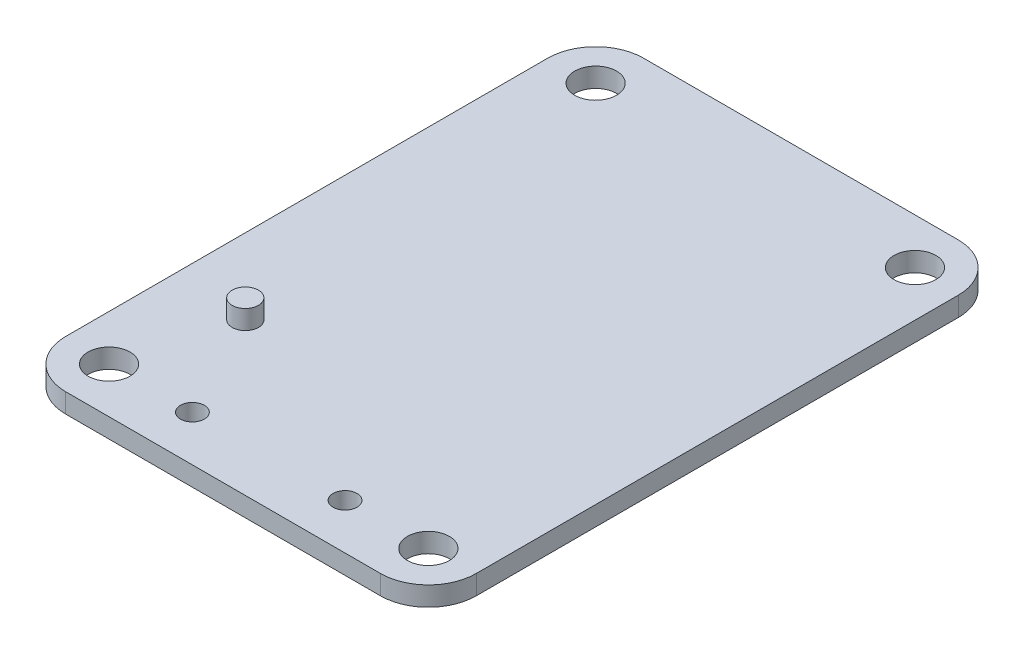
ISO-10303-21;
HEADER;
FILE_DESCRIPTION(('STEP AP214'),'2;1');
FILE_NAME('part.step','',(''),(''),'','','');
FILE_SCHEMA(('AUTOMOTIVE_DESIGN { 1 0 10303 214 1 1 1 1 }'));
ENDSEC;
DATA;
#1=APPLICATION_CONTEXT('core data for automotive mechanical design processes');
#2=APPLICATION_PROTOCOL_DEFINITION('international standard','automotive_design',2000,#1);
#3=PRODUCT_CONTEXT('',#1,'mechanical');
#4=PRODUCT('Part','Part','',(#3));
#5=PRODUCT_RELATED_PRODUCT_CATEGORY('part','',(#4));
#6=PRODUCT_DEFINITION_FORMATION('','',#4);
#7=PRODUCT_DEFINITION_CONTEXT('part definition',#1,'design');
#8=PRODUCT_DEFINITION('design','',#6,#7);
#9=PRODUCT_DEFINITION_SHAPE('','',#8);
#10=(LENGTH_UNIT() NAMED_UNIT(*) SI_UNIT(.MILLI.,.METRE.));
#11=(NAMED_UNIT(*) PLANE_ANGLE_UNIT() SI_UNIT($,.RADIAN.));
#12=(NAMED_UNIT(*) SI_UNIT($,.STERADIAN.) SOLID_ANGLE_UNIT());
#13=UNCERTAINTY_MEASURE_WITH_UNIT(LENGTH_MEASURE(1.E-05),#10,'distance_accuracy_value','');
#14=(GEOMETRIC_REPRESENTATION_CONTEXT(3) GLOBAL_UNCERTAINTY_ASSIGNED_CONTEXT((#13)) GLOBAL_UNIT_ASSIGNED_CONTEXT((#10,
#11,#12)) REPRESENTATION_CONTEXT('',''));
#15=CARTESIAN_POINT('',(0.,0.,0.));
#16=DIRECTION('',(0.,0.,1.));
#17=DIRECTION('',(1.,0.,0.));
#18=AXIS2_PLACEMENT_3D('',#15,#16,#17);
#19=CARTESIAN_POINT('',(0.,1.62,0.));
#20=DIRECTION('',(0.,1.,0.));
#21=DIRECTION('',(0.,0.,1.));
#22=AXIS2_PLACEMENT_3D('',#19,#20,#21);
#23=PLANE('',#22);
#24=CARTESIAN_POINT('',(6.3,1.62,-12.7));
#25=DIRECTION('',(0.,1.,0.));
#26=DIRECTION('',(0.,0.,1.));
#27=AXIS2_PLACEMENT_3D('',#24,#25,#26);
#28=CIRCLE('',#27,1.1);
#29=CARTESIAN_POINT('',(6.3,1.62,-11.6));
#30=VERTEX_POINT('',#29);
#31=EDGE_CURVE('E214',#30,#30,#28,.T.);
#32=ORIENTED_EDGE('',*,*,#31,.F.);
#33=EDGE_LOOP('',(#32));
#34=FACE_BOUND('',#33,.T.);
#35=DIRECTION('',(-1.,0.,0.));
#36=VECTOR('',#35,1.);
#37=CARTESIAN_POINT('',(0.,1.62,-48.26));
#38=LINE('',#37,#36);
#39=CARTESIAN_POINT('',(30.29,1.62,-48.26));
#40=VERTEX_POINT('',#39);
#41=CARTESIAN_POINT('',(4.,1.62,-48.26));
#42=VERTEX_POINT('',#41);
#43=EDGE_CURVE('E189',#40,#42,#38,.T.);
#44=ORIENTED_EDGE('',*,*,#43,.T.);
#45=CARTESIAN_POINT('',(4.,1.62,-44.26));
#46=DIRECTION('',(0.,1.,0.));
#47=DIRECTION('',(0.,0.,1.));
#48=AXIS2_PLACEMENT_3D('',#45,#46,#47);
#49=CIRCLE('',#48,4.);
#50=CARTESIAN_POINT('',(0.,1.62,-44.26));
#51=VERTEX_POINT('',#50);
#52=EDGE_CURVE('E92',#42,#51,#49,.T.);
#53=ORIENTED_EDGE('',*,*,#52,.T.);
#54=DIRECTION('',(0.,0.,1.));
#55=VECTOR('',#54,1.);
#56=CARTESIAN_POINT('',(0.,1.62,0.));
#57=LINE('',#56,#55);
#58=CARTESIAN_POINT('',(0.,1.62,-4.));
#59=VERTEX_POINT('',#58);
#60=EDGE_CURVE('E171',#51,#59,#57,.T.);
#61=ORIENTED_EDGE('',*,*,#60,.T.);
#62=CARTESIAN_POINT('',(4.,1.62,-4.));
#63=DIRECTION('',(0.,1.,0.));
#64=DIRECTION('',(0.,0.,1.));
#65=AXIS2_PLACEMENT_3D('',#62,#63,#64);
#66=CIRCLE('',#65,4.);
#67=CARTESIAN_POINT('',(4.,1.62,0.));
#68=VERTEX_POINT('',#67);
#69=EDGE_CURVE('E184',#59,#68,#66,.T.);
#70=ORIENTED_EDGE('',*,*,#69,.T.);
#71=DIRECTION('',(1.,0.,0.));
#72=VECTOR('',#71,1.);
#73=CARTESIAN_POINT('',(0.,1.62,0.));
#74=LINE('',#73,#72);
#75=CARTESIAN_POINT('',(30.29,1.62,0.));
#76=VERTEX_POINT('',#75);
#77=EDGE_CURVE('E111',#68,#76,#74,.T.);
#78=ORIENTED_EDGE('',*,*,#77,.T.);
#79=CARTESIAN_POINT('',(30.29,1.62,-4.));
#80=DIRECTION('',(0.,1.,0.));
#81=DIRECTION('',(0.,0.,1.));
#82=AXIS2_PLACEMENT_3D('',#79,#80,#81);
#83=CIRCLE('',#82,4.);
#84=CARTESIAN_POINT('',(34.29,1.62,-4.));
#85=VERTEX_POINT('',#84);
#86=EDGE_CURVE('E105',#76,#85,#83,.T.);
#87=ORIENTED_EDGE('',*,*,#86,.T.);
#88=DIRECTION('',(0.,0.,-1.));
#89=VECTOR('',#88,1.);
#90=CARTESIAN_POINT('',(34.29,1.62,0.));
#91=LINE('',#90,#89);
#92=CARTESIAN_POINT('',(34.29,1.62,-44.26));
#93=VERTEX_POINT('',#92);
#94=EDGE_CURVE('E109',#85,#93,#91,.T.);
#95=ORIENTED_EDGE('',*,*,#94,.T.);
#96=CARTESIAN_POINT('',(30.29,1.62,-44.26));
#97=DIRECTION('',(0.,1.,0.));
#98=DIRECTION('',(0.,0.,1.));
#99=AXIS2_PLACEMENT_3D('',#96,#97,#98);
#100=CIRCLE('',#99,4.);
#101=EDGE_CURVE('E49',#93,#40,#100,.T.);
#102=ORIENTED_EDGE('',*,*,#101,.T.);
#103=EDGE_LOOP('',(#44,#53,#61,#70,#78,#87,#95,#102));
#104=FACE_BOUND('',#103,.T.);
#105=CARTESIAN_POINT('',(3.81,1.62,-3.81));
#106=DIRECTION('',(0.,1.,0.));
#107=DIRECTION('',(0.,0.,1.));
#108=AXIS2_PLACEMENT_3D('',#105,#106,#107);
#109=CIRCLE('',#108,1.75);
#110=CARTESIAN_POINT('',(3.81,1.62,-2.06));
#111=VERTEX_POINT('',#110);
#112=EDGE_CURVE('E191',#111,#111,#109,.T.);
#113=ORIENTED_EDGE('',*,*,#112,.F.);
#114=EDGE_LOOP('',(#113));
#115=FACE_BOUND('',#114,.T.);
#116=CARTESIAN_POINT('',(30.48,1.62,-3.81));
#117=DIRECTION('',(0.,1.,0.));
#118=DIRECTION('',(0.,0.,1.));
#119=AXIS2_PLACEMENT_3D('',#116,#117,#118);
#120=CIRCLE('',#119,1.75);
#121=CARTESIAN_POINT('',(30.48,1.62,-2.06));
#122=VERTEX_POINT('',#121);
#123=EDGE_CURVE('E194',#122,#122,#120,.T.);
#124=ORIENTED_EDGE('',*,*,#123,.F.);
#125=EDGE_LOOP('',(#124));
#126=FACE_BOUND('',#125,.T.);
#127=CARTESIAN_POINT('',(3.81,1.62,-44.45));
#128=DIRECTION('',(0.,1.,0.));
#129=DIRECTION('',(0.,0.,1.));
#130=AXIS2_PLACEMENT_3D('',#127,#128,#129);
#131=CIRCLE('',#130,1.75);
#132=CARTESIAN_POINT('',(3.81,1.62,-42.7));
#133=VERTEX_POINT('',#132);
#134=EDGE_CURVE('E197',#133,#133,#131,.T.);
#135=ORIENTED_EDGE('',*,*,#134,.F.);
#136=EDGE_LOOP('',(#135));
#137=FACE_BOUND('',#136,.T.);
#138=CARTESIAN_POINT('',(30.48,1.62,-44.45));
#139=DIRECTION('',(0.,1.,0.));
#140=DIRECTION('',(0.,0.,1.));
#141=AXIS2_PLACEMENT_3D('',#138,#139,#140);
#142=CIRCLE('',#141,1.75);
#143=CARTESIAN_POINT('',(30.48,1.62,-42.7));
#144=VERTEX_POINT('',#143);
#145=EDGE_CURVE('E156',#144,#144,#142,.T.);
#146=ORIENTED_EDGE('',*,*,#145,.F.);
#147=EDGE_LOOP('',(#146));
#148=FACE_BOUND('',#147,.T.);
#149=CARTESIAN_POINT('',(10.77,1.62,-3.81));
#150=DIRECTION('',(0.,1.,0.));
#151=DIRECTION('',(0.,0.,1.));
#152=AXIS2_PLACEMENT_3D('',#149,#150,#151);
#153=CIRCLE('',#152,1.);
#154=CARTESIAN_POINT('',(10.77,1.62,-2.81));
#155=VERTEX_POINT('',#154);
#156=EDGE_CURVE('E205',#155,#155,#153,.T.);
#157=ORIENTED_EDGE('',*,*,#156,.F.);
#158=EDGE_LOOP('',(#157));
#159=FACE_BOUND('',#158,.T.);
#160=CARTESIAN_POINT('',(23.52,1.62,-3.81));
#161=DIRECTION('',(0.,1.,0.));
#162=DIRECTION('',(0.,0.,1.));
#163=AXIS2_PLACEMENT_3D('',#160,#161,#162);
#164=CIRCLE('',#163,1.);
#165=CARTESIAN_POINT('',(23.52,1.62,-2.81));
#166=VERTEX_POINT('',#165);
#167=EDGE_CURVE('E209',#166,#166,#164,.F.);
#168=ORIENTED_EDGE('',*,*,#167,.T.);
#169=EDGE_LOOP('',(#168));
#170=FACE_BOUND('',#169,.T.);
#171=ADVANCED_FACE('F32',(#34,#104,#115,#126,#137,#148,#159,#170),#23,.T.);
#172=CARTESIAN_POINT('',(0.,0.,0.));
#173=DIRECTION('',(0.,1.,0.));
#174=DIRECTION('',(0.,0.,1.));
#175=AXIS2_PLACEMENT_3D('',#172,#173,#174);
#176=PLANE('',#175);
#177=CARTESIAN_POINT('',(10.77,0.,-3.81));
#178=DIRECTION('',(0.,1.,0.));
#179=DIRECTION('',(0.,0.,1.));
#180=AXIS2_PLACEMENT_3D('',#177,#178,#179);
#181=CIRCLE('',#180,1.);
#182=CARTESIAN_POINT('',(10.77,0.,-2.81));
#183=VERTEX_POINT('',#182);
#184=EDGE_CURVE('E202',#183,#183,#181,.T.);
#185=ORIENTED_EDGE('',*,*,#184,.T.);
#186=EDGE_LOOP('',(#185));
#187=FACE_BOUND('',#186,.T.);
#188=CARTESIAN_POINT('',(30.48,0.,-44.45));
#189=DIRECTION('',(0.,1.,0.));
#190=DIRECTION('',(0.,0.,1.));
#191=AXIS2_PLACEMENT_3D('',#188,#189,#190);
#192=CIRCLE('',#191,1.75);
#193=CARTESIAN_POINT('',(30.48,0.,-42.7));
#194=VERTEX_POINT('',#193);
#195=EDGE_CURVE('E129',#194,#194,#192,.T.);
#196=ORIENTED_EDGE('',*,*,#195,.T.);
#197=EDGE_LOOP('',(#196));
#198=FACE_BOUND('',#197,.T.);
#199=CARTESIAN_POINT('',(3.81,0.,-44.45));
#200=DIRECTION('',(0.,1.,0.));
#201=DIRECTION('',(0.,0.,1.));
#202=AXIS2_PLACEMENT_3D('',#199,#200,#201);
#203=CIRCLE('',#202,1.75);
#204=CARTESIAN_POINT('',(3.81,0.,-42.7));
#205=VERTEX_POINT('',#204);
#206=EDGE_CURVE('E132',#205,#205,#203,.T.);
#207=ORIENTED_EDGE('',*,*,#206,.T.);
#208=EDGE_LOOP('',(#207));
#209=FACE_BOUND('',#208,.T.);
#210=CARTESIAN_POINT('',(30.48,0.,-3.81));
#211=DIRECTION('',(0.,1.,0.));
#212=DIRECTION('',(0.,0.,1.));
#213=AXIS2_PLACEMENT_3D('',#210,#211,#212);
#214=CIRCLE('',#213,1.75);
#215=CARTESIAN_POINT('',(30.48,0.,-2.06));
#216=VERTEX_POINT('',#215);
#217=EDGE_CURVE('E136',#216,#216,#214,.T.);
#218=ORIENTED_EDGE('',*,*,#217,.T.);
#219=EDGE_LOOP('',(#218));
#220=FACE_BOUND('',#219,.T.);
#221=CARTESIAN_POINT('',(3.81,0.,-3.81));
#222=DIRECTION('',(0.,1.,0.));
#223=DIRECTION('',(0.,0.,1.));
#224=AXIS2_PLACEMENT_3D('',#221,#222,#223);
#225=CIRCLE('',#224,1.75);
#226=CARTESIAN_POINT('',(3.81,0.,-2.06));
#227=VERTEX_POINT('',#226);
#228=EDGE_CURVE('E139',#227,#227,#225,.T.);
#229=ORIENTED_EDGE('',*,*,#228,.T.);
#230=EDGE_LOOP('',(#229));
#231=FACE_BOUND('',#230,.T.);
#232=DIRECTION('',(-1.,0.,0.));
#233=VECTOR('',#232,1.);
#234=CARTESIAN_POINT('',(0.,0.,-48.26));
#235=LINE('',#234,#233);
#236=CARTESIAN_POINT('',(30.29,0.,-48.26));
#237=VERTEX_POINT('',#236);
#238=CARTESIAN_POINT('',(4.,0.,-48.26));
#239=VERTEX_POINT('',#238);
#240=EDGE_CURVE('E142',#237,#239,#235,.T.);
#241=ORIENTED_EDGE('',*,*,#240,.F.);
#242=CARTESIAN_POINT('',(30.29,0.,-44.26));
#243=DIRECTION('',(0.,1.,0.));
#244=DIRECTION('',(0.,0.,1.));
#245=AXIS2_PLACEMENT_3D('',#242,#243,#244);
#246=CIRCLE('',#245,4.);
#247=CARTESIAN_POINT('',(34.29,0.,-44.26));
#248=VERTEX_POINT('',#247);
#249=EDGE_CURVE('E84',#248,#237,#246,.T.);
#250=ORIENTED_EDGE('',*,*,#249,.F.);
#251=DIRECTION('',(0.,0.,-1.));
#252=VECTOR('',#251,1.);
#253=CARTESIAN_POINT('',(34.29,0.,0.));
#254=LINE('',#253,#252);
#255=CARTESIAN_POINT('',(34.29,0.,-4.));
#256=VERTEX_POINT('',#255);
#257=EDGE_CURVE('E78',#256,#248,#254,.T.);
#258=ORIENTED_EDGE('',*,*,#257,.F.);
#259=CARTESIAN_POINT('',(30.29,0.,-4.));
#260=DIRECTION('',(0.,1.,0.));
#261=DIRECTION('',(0.,0.,1.));
#262=AXIS2_PLACEMENT_3D('',#259,#260,#261);
#263=CIRCLE('',#262,4.);
#264=CARTESIAN_POINT('',(30.29,0.,0.));
#265=VERTEX_POINT('',#264);
#266=EDGE_CURVE('E119',#265,#256,#263,.T.);
#267=ORIENTED_EDGE('',*,*,#266,.F.);
#268=DIRECTION('',(1.,0.,0.));
#269=VECTOR('',#268,1.);
#270=CARTESIAN_POINT('',(0.,0.,0.));
#271=LINE('',#270,#269);
#272=CARTESIAN_POINT('',(4.,0.,0.));
#273=VERTEX_POINT('',#272);
#274=EDGE_CURVE('E151',#273,#265,#271,.T.);
#275=ORIENTED_EDGE('',*,*,#274,.F.);
#276=CARTESIAN_POINT('',(4.,0.,-4.));
#277=DIRECTION('',(0.,1.,0.));
#278=DIRECTION('',(0.,0.,1.));
#279=AXIS2_PLACEMENT_3D('',#276,#277,#278);
#280=CIRCLE('',#279,4.);
#281=CARTESIAN_POINT('',(0.,0.,-4.));
#282=VERTEX_POINT('',#281);
#283=EDGE_CURVE('E149',#282,#273,#280,.T.);
#284=ORIENTED_EDGE('',*,*,#283,.F.);
#285=DIRECTION('',(0.,0.,1.));
#286=VECTOR('',#285,1.);
#287=CARTESIAN_POINT('',(0.,0.,0.));
#288=LINE('',#287,#286);
#289=CARTESIAN_POINT('',(0.,0.,-44.26));
#290=VERTEX_POINT('',#289);
#291=EDGE_CURVE('E147',#290,#282,#288,.T.);
#292=ORIENTED_EDGE('',*,*,#291,.F.);
#293=CARTESIAN_POINT('',(4.,0.,-44.26));
#294=DIRECTION('',(0.,1.,0.));
#295=DIRECTION('',(0.,0.,1.));
#296=AXIS2_PLACEMENT_3D('',#293,#294,#295);
#297=CIRCLE('',#296,4.);
#298=EDGE_CURVE('E145',#239,#290,#297,.T.);
#299=ORIENTED_EDGE('',*,*,#298,.F.);
#300=EDGE_LOOP('',(#241,#250,#258,#267,#275,#284,#292,#299));
#301=FACE_BOUND('',#300,.T.);
#302=CARTESIAN_POINT('',(23.52,0.,-3.81));
#303=DIRECTION('',(0.,1.,0.));
#304=DIRECTION('',(0.,0.,1.));
#305=AXIS2_PLACEMENT_3D('',#302,#303,#304);
#306=CIRCLE('',#305,1.);
#307=CARTESIAN_POINT('',(23.52,0.,-2.81));
#308=VERTEX_POINT('',#307);
#309=EDGE_CURVE('E133',#308,#308,#306,.F.);
#310=ORIENTED_EDGE('',*,*,#309,.F.);
#311=EDGE_LOOP('',(#310));
#312=FACE_BOUND('',#311,.T.);
#313=ADVANCED_FACE('F175',(#187,#198,#209,#220,#231,#301,#312),#176,.F.);
#314=CARTESIAN_POINT('',(0.,1.62,-48.26));
#315=DIRECTION('',(0.,0.,1.));
#316=DIRECTION('',(1.,0.,0.));
#317=AXIS2_PLACEMENT_3D('',#314,#315,#316);
#318=PLANE('',#317);
#319=ORIENTED_EDGE('',*,*,#240,.T.);
#320=DIRECTION('',(0.,-1.,0.));
#321=VECTOR('',#320,1.);
#322=CARTESIAN_POINT('',(4.,1.62,-48.26));
#323=LINE('',#322,#321);
#324=EDGE_CURVE('E11',#42,#239,#323,.T.);
#325=ORIENTED_EDGE('',*,*,#324,.F.);
#326=ORIENTED_EDGE('',*,*,#43,.F.);
#327=DIRECTION('',(0.,-1.,0.));
#328=VECTOR('',#327,1.);
#329=CARTESIAN_POINT('',(30.29,1.62,-48.26));
#330=LINE('',#329,#328);
#331=EDGE_CURVE('E125',#40,#237,#330,.T.);
#332=ORIENTED_EDGE('',*,*,#331,.T.);
#333=EDGE_LOOP('',(#319,#325,#326,#332));
#334=FACE_BOUND('',#333,.T.);
#335=ADVANCED_FACE('F234',(#334),#318,.F.);
#336=CARTESIAN_POINT('',(4.,1.62,-44.26));
#337=DIRECTION('',(0.,-1.,0.));
#338=DIRECTION('',(0.,0.,-1.));
#339=AXIS2_PLACEMENT_3D('',#336,#337,#338);
#340=CYLINDRICAL_SURFACE('',#339,4.);
#341=ORIENTED_EDGE('',*,*,#298,.T.);
#342=DIRECTION('',(0.,-1.,0.));
#343=VECTOR('',#342,1.);
#344=CARTESIAN_POINT('',(0.,1.62,-44.26));
#345=LINE('',#344,#343);
#346=EDGE_CURVE('E41',#51,#290,#345,.T.);
#347=ORIENTED_EDGE('',*,*,#346,.F.);
#348=ORIENTED_EDGE('',*,*,#52,.F.);
#349=ORIENTED_EDGE('',*,*,#324,.T.);
#350=EDGE_LOOP('',(#341,#347,#348,#349));
#351=FACE_BOUND('',#350,.T.);
#352=ADVANCED_FACE('F255',(#351),#340,.T.);
#353=CARTESIAN_POINT('',(0.,1.62,0.));
#354=DIRECTION('',(1.,0.,0.));
#355=DIRECTION('',(0.,0.,-1.));
#356=AXIS2_PLACEMENT_3D('',#353,#354,#355);
#357=PLANE('',#356);
#358=ORIENTED_EDGE('',*,*,#291,.T.);
#359=DIRECTION('',(0.,-1.,0.));
#360=VECTOR('',#359,1.);
#361=CARTESIAN_POINT('',(0.,1.62,-4.));
#362=LINE('',#361,#360);
#363=EDGE_CURVE('E163',#59,#282,#362,.T.);
#364=ORIENTED_EDGE('',*,*,#363,.F.);
#365=ORIENTED_EDGE('',*,*,#60,.F.);
#366=ORIENTED_EDGE('',*,*,#346,.T.);
#367=EDGE_LOOP('',(#358,#364,#365,#366));
#368=FACE_BOUND('',#367,.T.);
#369=ADVANCED_FACE('F169',(#368),#357,.F.);
#370=CARTESIAN_POINT('',(4.,1.62,-4.));
#371=DIRECTION('',(0.,-1.,0.));
#372=DIRECTION('',(0.,0.,-1.));
#373=AXIS2_PLACEMENT_3D('',#370,#371,#372);
#374=CYLINDRICAL_SURFACE('',#373,4.);
#375=ORIENTED_EDGE('',*,*,#283,.T.);
#376=DIRECTION('',(0.,-1.,0.));
#377=VECTOR('',#376,1.);
#378=CARTESIAN_POINT('',(4.,1.62,0.));
#379=LINE('',#378,#377);
#380=EDGE_CURVE('E160',#68,#273,#379,.T.);
#381=ORIENTED_EDGE('',*,*,#380,.F.);
#382=ORIENTED_EDGE('',*,*,#69,.F.);
#383=ORIENTED_EDGE('',*,*,#363,.T.);
#384=EDGE_LOOP('',(#375,#381,#382,#383));
#385=FACE_BOUND('',#384,.T.);
#386=ADVANCED_FACE('F180',(#385),#374,.T.);
#387=CARTESIAN_POINT('',(0.,1.62,0.));
#388=DIRECTION('',(0.,0.,-1.));
#389=DIRECTION('',(-1.,0.,0.));
#390=AXIS2_PLACEMENT_3D('',#387,#388,#389);
#391=PLANE('',#390);
#392=ORIENTED_EDGE('',*,*,#274,.T.);
#393=DIRECTION('',(0.,-1.,0.));
#394=VECTOR('',#393,1.);
#395=CARTESIAN_POINT('',(30.29,1.62,0.));
#396=LINE('',#395,#394);
#397=EDGE_CURVE('E120',#76,#265,#396,.T.);
#398=ORIENTED_EDGE('',*,*,#397,.F.);
#399=ORIENTED_EDGE('',*,*,#77,.F.);
#400=ORIENTED_EDGE('',*,*,#380,.T.);
#401=EDGE_LOOP('',(#392,#398,#399,#400));
#402=FACE_BOUND('',#401,.T.);
#403=ADVANCED_FACE('F183',(#402),#391,.F.);
#404=CARTESIAN_POINT('',(30.29,1.62,-4.));
#405=DIRECTION('',(0.,-1.,0.));
#406=DIRECTION('',(0.,0.,-1.));
#407=AXIS2_PLACEMENT_3D('',#404,#405,#406);
#408=CYLINDRICAL_SURFACE('',#407,4.);
#409=ORIENTED_EDGE('',*,*,#266,.T.);
#410=DIRECTION('',(0.,-1.,0.));
#411=VECTOR('',#410,1.);
#412=CARTESIAN_POINT('',(34.29,1.62,-4.));
#413=LINE('',#412,#411);
#414=EDGE_CURVE('E116',#85,#256,#413,.T.);
#415=ORIENTED_EDGE('',*,*,#414,.F.);
#416=ORIENTED_EDGE('',*,*,#86,.F.);
#417=ORIENTED_EDGE('',*,*,#397,.T.);
#418=EDGE_LOOP('',(#409,#415,#416,#417));
#419=FACE_BOUND('',#418,.T.);
#420=ADVANCED_FACE('F117',(#419),#408,.T.);
#421=CARTESIAN_POINT('',(34.29,1.62,0.));
#422=DIRECTION('',(-1.,0.,0.));
#423=DIRECTION('',(0.,0.,1.));
#424=AXIS2_PLACEMENT_3D('',#421,#422,#423);
#425=PLANE('',#424);
#426=ORIENTED_EDGE('',*,*,#257,.T.);
#427=DIRECTION('',(0.,-1.,0.));
#428=VECTOR('',#427,1.);
#429=CARTESIAN_POINT('',(34.29,1.62,-44.26));
#430=LINE('',#429,#428);
#431=EDGE_CURVE('E121',#93,#248,#430,.T.);
#432=ORIENTED_EDGE('',*,*,#431,.F.);
#433=ORIENTED_EDGE('',*,*,#94,.F.);
#434=ORIENTED_EDGE('',*,*,#414,.T.);
#435=EDGE_LOOP('',(#426,#432,#433,#434));
#436=FACE_BOUND('',#435,.T.);
#437=ADVANCED_FACE('F123',(#436),#425,.F.);
#438=CARTESIAN_POINT('',(3.81,1.62,-3.81));
#439=DIRECTION('',(0.,-1.,0.));
#440=DIRECTION('',(0.,0.,-1.));
#441=AXIS2_PLACEMENT_3D('',#438,#439,#440);
#442=CYLINDRICAL_SURFACE('',#441,1.75);
#443=ORIENTED_EDGE('',*,*,#112,.T.);
#444=EDGE_LOOP('',(#443));
#445=FACE_BOUND('',#444,.T.);
#446=ORIENTED_EDGE('',*,*,#228,.F.);
#447=EDGE_LOOP('',(#446));
#448=FACE_BOUND('',#447,.T.);
#449=ADVANCED_FACE('F246',(#445,#448),#442,.F.);
#450=CARTESIAN_POINT('',(30.48,1.62,-3.81));
#451=DIRECTION('',(0.,-1.,0.));
#452=DIRECTION('',(0.,0.,-1.));
#453=AXIS2_PLACEMENT_3D('',#450,#451,#452);
#454=CYLINDRICAL_SURFACE('',#453,1.75);
#455=ORIENTED_EDGE('',*,*,#123,.T.);
#456=EDGE_LOOP('',(#455));
#457=FACE_BOUND('',#456,.T.);
#458=ORIENTED_EDGE('',*,*,#217,.F.);
#459=EDGE_LOOP('',(#458));
#460=FACE_BOUND('',#459,.T.);
#461=ADVANCED_FACE('F263',(#457,#460),#454,.F.);
#462=CARTESIAN_POINT('',(3.81,1.62,-44.45));
#463=DIRECTION('',(0.,-1.,0.));
#464=DIRECTION('',(0.,0.,-1.));
#465=AXIS2_PLACEMENT_3D('',#462,#463,#464);
#466=CYLINDRICAL_SURFACE('',#465,1.75);
#467=ORIENTED_EDGE('',*,*,#134,.T.);
#468=EDGE_LOOP('',(#467));
#469=FACE_BOUND('',#468,.T.);
#470=ORIENTED_EDGE('',*,*,#206,.F.);
#471=EDGE_LOOP('',(#470));
#472=FACE_BOUND('',#471,.T.);
#473=ADVANCED_FACE('F266',(#469,#472),#466,.F.);
#474=CARTESIAN_POINT('',(30.48,1.62,-44.45));
#475=DIRECTION('',(0.,-1.,0.));
#476=DIRECTION('',(0.,0.,-1.));
#477=AXIS2_PLACEMENT_3D('',#474,#475,#476);
#478=CYLINDRICAL_SURFACE('',#477,1.75);
#479=ORIENTED_EDGE('',*,*,#145,.T.);
#480=EDGE_LOOP('',(#479));
#481=FACE_BOUND('',#480,.T.);
#482=ORIENTED_EDGE('',*,*,#195,.F.);
#483=EDGE_LOOP('',(#482));
#484=FACE_BOUND('',#483,.T.);
#485=ADVANCED_FACE('F34',(#481,#484),#478,.F.);
#486=CARTESIAN_POINT('',(30.29,1.62,-44.26));
#487=DIRECTION('',(0.,-1.,0.));
#488=DIRECTION('',(0.,0.,-1.));
#489=AXIS2_PLACEMENT_3D('',#486,#487,#488);
#490=CYLINDRICAL_SURFACE('',#489,4.);
#491=ORIENTED_EDGE('',*,*,#249,.T.);
#492=ORIENTED_EDGE('',*,*,#331,.F.);
#493=ORIENTED_EDGE('',*,*,#101,.F.);
#494=ORIENTED_EDGE('',*,*,#431,.T.);
#495=EDGE_LOOP('',(#491,#492,#493,#494));
#496=FACE_BOUND('',#495,.T.);
#497=ADVANCED_FACE('F241',(#496),#490,.T.);
#498=CARTESIAN_POINT('',(10.77,0.,-3.81));
#499=DIRECTION('',(0.,1.,0.));
#500=DIRECTION('',(0.,0.,1.));
#501=AXIS2_PLACEMENT_3D('',#498,#499,#500);
#502=CYLINDRICAL_SURFACE('',#501,1.);
#503=ORIENTED_EDGE('',*,*,#184,.F.);
#504=EDGE_LOOP('',(#503));
#505=FACE_BOUND('',#504,.T.);
#506=ORIENTED_EDGE('',*,*,#156,.T.);
#507=EDGE_LOOP('',(#506));
#508=FACE_BOUND('',#507,.T.);
#509=ADVANCED_FACE('F238',(#505,#508),#502,.F.);
#510=CARTESIAN_POINT('',(23.52,0.,-3.81));
#511=DIRECTION('',(0.,1.,0.));
#512=DIRECTION('',(0.,0.,1.));
#513=AXIS2_PLACEMENT_3D('',#510,#511,#512);
#514=CYLINDRICAL_SURFACE('',#513,1.);
#515=ORIENTED_EDGE('',*,*,#309,.T.);
#516=EDGE_LOOP('',(#515));
#517=FACE_BOUND('',#516,.T.);
#518=ORIENTED_EDGE('',*,*,#167,.F.);
#519=EDGE_LOOP('',(#518));
#520=FACE_BOUND('',#519,.T.);
#521=ADVANCED_FACE('F225',(#517,#520),#514,.F.);
#522=CARTESIAN_POINT('',(6.3,3.22,-12.7));
#523=DIRECTION('',(0.,-1.,0.));
#524=DIRECTION('',(0.,0.,-1.));
#525=AXIS2_PLACEMENT_3D('',#522,#523,#524);
#526=CYLINDRICAL_SURFACE('',#525,1.1);
#527=CARTESIAN_POINT('',(6.3,3.22,-12.7));
#528=DIRECTION('',(0.,1.,0.));
#529=DIRECTION('',(0.,0.,1.));
#530=AXIS2_PLACEMENT_3D('',#527,#528,#529);
#531=CIRCLE('',#530,1.1);
#532=CARTESIAN_POINT('',(6.3,3.22,-11.6));
#533=VERTEX_POINT('',#532);
#534=EDGE_CURVE('E206',#533,#533,#531,.T.);
#535=ORIENTED_EDGE('',*,*,#534,.F.);
#536=EDGE_LOOP('',(#535));
#537=FACE_BOUND('',#536,.T.);
#538=ORIENTED_EDGE('',*,*,#31,.T.);
#539=EDGE_LOOP('',(#538));
#540=FACE_BOUND('',#539,.T.);
#541=ADVANCED_FACE('F222',(#537,#540),#526,.T.);
#542=CARTESIAN_POINT('',(6.3,3.22,-12.7));
#543=DIRECTION('',(0.,1.,0.));
#544=DIRECTION('',(0.,0.,1.));
#545=AXIS2_PLACEMENT_3D('',#542,#543,#544);
#546=PLANE('',#545);
#547=ORIENTED_EDGE('',*,*,#534,.T.);
#548=EDGE_LOOP('',(#547));
#549=FACE_BOUND('',#548,.T.);
#550=ADVANCED_FACE('F220',(#549),#546,.T.);
#551=CLOSED_SHELL('',(#171,#313,#335,#352,#369,#386,#403,#420,#437,#449,#461,#473,#485,#497,
#509,#521,#541,#550));
#552=MANIFOLD_SOLID_BREP('B2',#551);
#553=ADVANCED_BREP_SHAPE_REPRESENTATION('',(#18,#552),#14);
#554=SHAPE_DEFINITION_REPRESENTATION(#9,#553);
ENDSEC;
END-ISO-10303-21;
